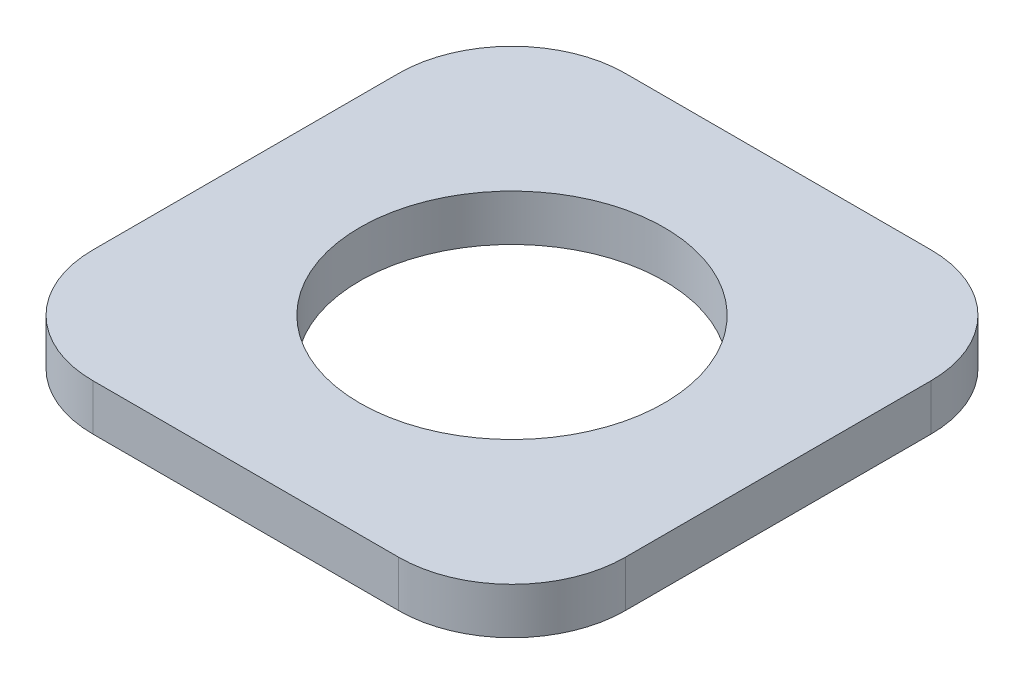
ISO-10303-21;
HEADER;
FILE_DESCRIPTION(('STEP AP214'),'2;1');
FILE_NAME('part.step','',(''),(''),'','','');
FILE_SCHEMA(('AUTOMOTIVE_DESIGN { 1 0 10303 214 1 1 1 1 }'));
ENDSEC;
DATA;
#1=APPLICATION_CONTEXT('core data for automotive mechanical design processes');
#2=APPLICATION_PROTOCOL_DEFINITION('international standard','automotive_design',2000,#1);
#3=PRODUCT_CONTEXT('',#1,'mechanical');
#4=PRODUCT('Part','Part','',(#3));
#5=PRODUCT_RELATED_PRODUCT_CATEGORY('part','',(#4));
#6=PRODUCT_DEFINITION_FORMATION('','',#4);
#7=PRODUCT_DEFINITION_CONTEXT('part definition',#1,'design');
#8=PRODUCT_DEFINITION('design','',#6,#7);
#9=PRODUCT_DEFINITION_SHAPE('','',#8);
#10=(LENGTH_UNIT() NAMED_UNIT(*) SI_UNIT(.MILLI.,.METRE.));
#11=(NAMED_UNIT(*) PLANE_ANGLE_UNIT() SI_UNIT($,.RADIAN.));
#12=(NAMED_UNIT(*) SI_UNIT($,.STERADIAN.) SOLID_ANGLE_UNIT());
#13=UNCERTAINTY_MEASURE_WITH_UNIT(LENGTH_MEASURE(1.E-05),#10,'distance_accuracy_value','');
#14=(GEOMETRIC_REPRESENTATION_CONTEXT(3) GLOBAL_UNCERTAINTY_ASSIGNED_CONTEXT((#13)) GLOBAL_UNIT_ASSIGNED_CONTEXT((#10,
#11,#12)) REPRESENTATION_CONTEXT('',''));
#15=CARTESIAN_POINT('',(0.,0.,0.));
#16=DIRECTION('',(0.,0.,1.));
#17=DIRECTION('',(1.,0.,0.));
#18=AXIS2_PLACEMENT_3D('',#15,#16,#17);
#19=CARTESIAN_POINT('',(46.99,8.1661,-46.99));
#20=DIRECTION('',(-1.,0.,0.));
#21=DIRECTION('',(0.,0.,1.));
#22=AXIS2_PLACEMENT_3D('',#19,#20,#21);
#23=PLANE('',#22);
#24=DIRECTION('',(0.,0.,-1.));
#25=VECTOR('',#24,1.);
#26=CARTESIAN_POINT('',(46.99,8.1661,-46.99));
#27=LINE('',#26,#25);
#28=CARTESIAN_POINT('',(46.99,8.1661,26.99));
#29=VERTEX_POINT('',#28);
#30=CARTESIAN_POINT('',(46.99,8.1661,-26.99));
#31=VERTEX_POINT('',#30);
#32=EDGE_CURVE('E138',#29,#31,#27,.T.);
#33=ORIENTED_EDGE('',*,*,#32,.F.);
#34=DIRECTION('',(0.,-1.,0.));
#35=VECTOR('',#34,1.);
#36=CARTESIAN_POINT('',(46.99,8.1661,26.99));
#37=LINE('',#36,#35);
#38=CARTESIAN_POINT('',(46.99,0.,26.99));
#39=VERTEX_POINT('',#38);
#40=EDGE_CURVE('E177',#29,#39,#37,.T.);
#41=ORIENTED_EDGE('',*,*,#40,.T.);
#42=DIRECTION('',(0.,0.,-1.));
#43=VECTOR('',#42,1.);
#44=CARTESIAN_POINT('',(46.99,0.,-46.99));
#45=LINE('',#44,#43);
#46=CARTESIAN_POINT('',(46.99,0.,-26.99));
#47=VERTEX_POINT('',#46);
#48=EDGE_CURVE('E192',#39,#47,#45,.T.);
#49=ORIENTED_EDGE('',*,*,#48,.T.);
#50=DIRECTION('',(0.,-1.,0.));
#51=VECTOR('',#50,1.);
#52=CARTESIAN_POINT('',(46.99,8.1661,-26.99));
#53=LINE('',#52,#51);
#54=EDGE_CURVE('E174',#47,#31,#53,.F.);
#55=ORIENTED_EDGE('',*,*,#54,.T.);
#56=EDGE_LOOP('',(#33,#41,#49,#55));
#57=FACE_BOUND('',#56,.T.);
#58=ADVANCED_FACE('F42',(#57),#23,.F.);
#59=CARTESIAN_POINT('',(-46.99,8.1661,-46.99));
#60=DIRECTION('',(0.,0.,1.));
#61=DIRECTION('',(1.,0.,0.));
#62=AXIS2_PLACEMENT_3D('',#59,#60,#61);
#63=PLANE('',#62);
#64=DIRECTION('',(-1.,0.,0.));
#65=VECTOR('',#64,1.);
#66=CARTESIAN_POINT('',(-46.99,8.1661,-46.99));
#67=LINE('',#66,#65);
#68=CARTESIAN_POINT('',(26.99,8.1661,-46.99));
#69=VERTEX_POINT('',#68);
#70=CARTESIAN_POINT('',(-26.99,8.1661,-46.99));
#71=VERTEX_POINT('',#70);
#72=EDGE_CURVE('E143',#69,#71,#67,.T.);
#73=ORIENTED_EDGE('',*,*,#72,.F.);
#74=DIRECTION('',(0.,-1.,0.));
#75=VECTOR('',#74,1.);
#76=CARTESIAN_POINT('',(26.99,8.1661,-46.99));
#77=LINE('',#76,#75);
#78=CARTESIAN_POINT('',(26.99,0.,-46.99));
#79=VERTEX_POINT('',#78);
#80=EDGE_CURVE('E11',#69,#79,#77,.T.);
#81=ORIENTED_EDGE('',*,*,#80,.T.);
#82=DIRECTION('',(-1.,0.,0.));
#83=VECTOR('',#82,1.);
#84=CARTESIAN_POINT('',(-46.99,0.,-46.99));
#85=LINE('',#84,#83);
#86=CARTESIAN_POINT('',(-26.99,0.,-46.99));
#87=VERTEX_POINT('',#86);
#88=EDGE_CURVE('E145',#79,#87,#85,.T.);
#89=ORIENTED_EDGE('',*,*,#88,.T.);
#90=DIRECTION('',(0.,-1.,0.));
#91=VECTOR('',#90,1.);
#92=CARTESIAN_POINT('',(-26.99,8.1661,-46.99));
#93=LINE('',#92,#91);
#94=EDGE_CURVE('E51',#87,#71,#93,.F.);
#95=ORIENTED_EDGE('',*,*,#94,.T.);
#96=EDGE_LOOP('',(#73,#81,#89,#95));
#97=FACE_BOUND('',#96,.T.);
#98=ADVANCED_FACE('F198',(#97),#63,.F.);
#99=CARTESIAN_POINT('',(-46.99,8.1661,-46.99));
#100=DIRECTION('',(1.,0.,0.));
#101=DIRECTION('',(0.,0.,-1.));
#102=AXIS2_PLACEMENT_3D('',#99,#100,#101);
#103=PLANE('',#102);
#104=DIRECTION('',(0.,0.,1.));
#105=VECTOR('',#104,1.);
#106=CARTESIAN_POINT('',(-46.99,0.,-46.99));
#107=LINE('',#106,#105);
#108=CARTESIAN_POINT('',(-46.99,0.,-26.99));
#109=VERTEX_POINT('',#108);
#110=CARTESIAN_POINT('',(-46.99,0.,26.99));
#111=VERTEX_POINT('',#110);
#112=EDGE_CURVE('E139',#109,#111,#107,.T.);
#113=ORIENTED_EDGE('',*,*,#112,.T.);
#114=DIRECTION('',(0.,-1.,0.));
#115=VECTOR('',#114,1.);
#116=CARTESIAN_POINT('',(-46.99,8.1661,26.99));
#117=LINE('',#116,#115);
#118=CARTESIAN_POINT('',(-46.99,8.1661,26.99));
#119=VERTEX_POINT('',#118);
#120=EDGE_CURVE('E114',#111,#119,#117,.F.);
#121=ORIENTED_EDGE('',*,*,#120,.T.);
#122=DIRECTION('',(0.,0.,1.));
#123=VECTOR('',#122,1.);
#124=CARTESIAN_POINT('',(-46.99,8.1661,-46.99));
#125=LINE('',#124,#123);
#126=CARTESIAN_POINT('',(-46.99,8.1661,-26.99));
#127=VERTEX_POINT('',#126);
#128=EDGE_CURVE('E183',#127,#119,#125,.T.);
#129=ORIENTED_EDGE('',*,*,#128,.F.);
#130=DIRECTION('',(0.,-1.,0.));
#131=VECTOR('',#130,1.);
#132=CARTESIAN_POINT('',(-46.99,8.1661,-26.99));
#133=LINE('',#132,#131);
#134=EDGE_CURVE('E120',#127,#109,#133,.T.);
#135=ORIENTED_EDGE('',*,*,#134,.T.);
#136=EDGE_LOOP('',(#113,#121,#129,#135));
#137=FACE_BOUND('',#136,.T.);
#138=ADVANCED_FACE('F205',(#137),#103,.F.);
#139=CARTESIAN_POINT('',(-46.99,8.1661,46.99));
#140=DIRECTION('',(0.,0.,-1.));
#141=DIRECTION('',(-1.,0.,0.));
#142=AXIS2_PLACEMENT_3D('',#139,#140,#141);
#143=PLANE('',#142);
#144=DIRECTION('',(1.,0.,0.));
#145=VECTOR('',#144,1.);
#146=CARTESIAN_POINT('',(-46.99,8.1661,46.99));
#147=LINE('',#146,#145);
#148=CARTESIAN_POINT('',(-26.99,8.1661,46.99));
#149=VERTEX_POINT('',#148);
#150=CARTESIAN_POINT('',(26.99,8.1661,46.99));
#151=VERTEX_POINT('',#150);
#152=EDGE_CURVE('E130',#149,#151,#147,.T.);
#153=ORIENTED_EDGE('',*,*,#152,.F.);
#154=DIRECTION('',(0.,-1.,0.));
#155=VECTOR('',#154,1.);
#156=CARTESIAN_POINT('',(-26.99,8.1661,46.99));
#157=LINE('',#156,#155);
#158=CARTESIAN_POINT('',(-26.99,0.,46.99));
#159=VERTEX_POINT('',#158);
#160=EDGE_CURVE('E113',#149,#159,#157,.T.);
#161=ORIENTED_EDGE('',*,*,#160,.T.);
#162=DIRECTION('',(1.,0.,0.));
#163=VECTOR('',#162,1.);
#164=CARTESIAN_POINT('',(-46.99,0.,46.99));
#165=LINE('',#164,#163);
#166=CARTESIAN_POINT('',(26.99,0.,46.99));
#167=VERTEX_POINT('',#166);
#168=EDGE_CURVE('E127',#159,#167,#165,.T.);
#169=ORIENTED_EDGE('',*,*,#168,.T.);
#170=DIRECTION('',(0.,-1.,0.));
#171=VECTOR('',#170,1.);
#172=CARTESIAN_POINT('',(26.99,8.1661,46.99));
#173=LINE('',#172,#171);
#174=EDGE_CURVE('E133',#167,#151,#173,.F.);
#175=ORIENTED_EDGE('',*,*,#174,.T.);
#176=EDGE_LOOP('',(#153,#161,#169,#175));
#177=FACE_BOUND('',#176,.T.);
#178=ADVANCED_FACE('F126',(#177),#143,.F.);
#179=CARTESIAN_POINT('',(0.,8.1661,0.));
#180=DIRECTION('',(0.,1.,0.));
#181=DIRECTION('',(0.,0.,1.));
#182=AXIS2_PLACEMENT_3D('',#179,#180,#181);
#183=PLANE('',#182);
#184=CARTESIAN_POINT('',(0.,8.1661,0.));
#185=DIRECTION('',(0.,1.,0.));
#186=DIRECTION('',(0.,0.,1.));
#187=AXIS2_PLACEMENT_3D('',#184,#185,#186);
#188=CIRCLE('',#187,26.8605);
#189=CARTESIAN_POINT('',(0.,8.1661,26.8605));
#190=VERTEX_POINT('',#189);
#191=EDGE_CURVE('E332',#190,#190,#188,.T.);
#192=ORIENTED_EDGE('',*,*,#191,.F.);
#193=EDGE_LOOP('',(#192));
#194=FACE_BOUND('',#193,.T.);
#195=ORIENTED_EDGE('',*,*,#128,.T.);
#196=CARTESIAN_POINT('',(-26.99,8.1661,26.99));
#197=DIRECTION('',(0.,1.,0.));
#198=DIRECTION('',(0.,0.,1.));
#199=AXIS2_PLACEMENT_3D('',#196,#197,#198);
#200=CIRCLE('',#199,20.);
#201=EDGE_CURVE('E171',#119,#149,#200,.T.);
#202=ORIENTED_EDGE('',*,*,#201,.T.);
#203=ORIENTED_EDGE('',*,*,#152,.T.);
#204=CARTESIAN_POINT('',(26.99,8.1661,26.99));
#205=DIRECTION('',(0.,1.,0.));
#206=DIRECTION('',(0.,0.,1.));
#207=AXIS2_PLACEMENT_3D('',#204,#205,#206);
#208=CIRCLE('',#207,20.);
#209=EDGE_CURVE('E168',#151,#29,#208,.T.);
#210=ORIENTED_EDGE('',*,*,#209,.T.);
#211=ORIENTED_EDGE('',*,*,#32,.T.);
#212=CARTESIAN_POINT('',(26.99,8.1661,-26.99));
#213=DIRECTION('',(0.,1.,0.));
#214=DIRECTION('',(0.,0.,1.));
#215=AXIS2_PLACEMENT_3D('',#212,#213,#214);
#216=CIRCLE('',#215,20.);
#217=EDGE_CURVE('E64',#31,#69,#216,.T.);
#218=ORIENTED_EDGE('',*,*,#217,.T.);
#219=ORIENTED_EDGE('',*,*,#72,.T.);
#220=CARTESIAN_POINT('',(-26.99,8.1661,-26.99));
#221=DIRECTION('',(0.,1.,0.));
#222=DIRECTION('',(0.,0.,1.));
#223=AXIS2_PLACEMENT_3D('',#220,#221,#222);
#224=CIRCLE('',#223,20.);
#225=EDGE_CURVE('E163',#71,#127,#224,.T.);
#226=ORIENTED_EDGE('',*,*,#225,.T.);
#227=EDGE_LOOP('',(#195,#202,#203,#210,#211,#218,#219,#226));
#228=FACE_BOUND('',#227,.T.);
#229=ADVANCED_FACE('F203',(#194,#228),#183,.T.);
#230=CARTESIAN_POINT('',(0.,0.,0.));
#231=DIRECTION('',(0.,1.,0.));
#232=DIRECTION('',(0.,0.,1.));
#233=AXIS2_PLACEMENT_3D('',#230,#231,#232);
#234=PLANE('',#233);
#235=CARTESIAN_POINT('',(0.,0.,0.));
#236=DIRECTION('',(0.,1.,0.));
#237=DIRECTION('',(0.,0.,1.));
#238=AXIS2_PLACEMENT_3D('',#235,#236,#237);
#239=CIRCLE('',#238,26.8605);
#240=CARTESIAN_POINT('',(0.,0.,26.8605));
#241=VERTEX_POINT('',#240);
#242=EDGE_CURVE('E195',#241,#241,#239,.T.);
#243=ORIENTED_EDGE('',*,*,#242,.T.);
#244=EDGE_LOOP('',(#243));
#245=FACE_BOUND('',#244,.T.);
#246=ORIENTED_EDGE('',*,*,#168,.F.);
#247=CARTESIAN_POINT('',(-26.99,0.,26.99));
#248=DIRECTION('',(0.,1.,0.));
#249=DIRECTION('',(0.,0.,1.));
#250=AXIS2_PLACEMENT_3D('',#247,#248,#249);
#251=CIRCLE('',#250,20.);
#252=EDGE_CURVE('E109',#159,#111,#251,.F.);
#253=ORIENTED_EDGE('',*,*,#252,.T.);
#254=ORIENTED_EDGE('',*,*,#112,.F.);
#255=CARTESIAN_POINT('',(-26.99,0.,-26.99));
#256=DIRECTION('',(0.,1.,0.));
#257=DIRECTION('',(0.,0.,1.));
#258=AXIS2_PLACEMENT_3D('',#255,#256,#257);
#259=CIRCLE('',#258,20.);
#260=EDGE_CURVE('E132',#109,#87,#259,.F.);
#261=ORIENTED_EDGE('',*,*,#260,.T.);
#262=ORIENTED_EDGE('',*,*,#88,.F.);
#263=CARTESIAN_POINT('',(26.99,0.,-26.99));
#264=DIRECTION('',(0.,1.,0.));
#265=DIRECTION('',(0.,0.,1.));
#266=AXIS2_PLACEMENT_3D('',#263,#264,#265);
#267=CIRCLE('',#266,20.);
#268=EDGE_CURVE('E153',#79,#47,#267,.F.);
#269=ORIENTED_EDGE('',*,*,#268,.T.);
#270=ORIENTED_EDGE('',*,*,#48,.F.);
#271=CARTESIAN_POINT('',(26.99,0.,26.99));
#272=DIRECTION('',(0.,1.,0.));
#273=DIRECTION('',(0.,0.,1.));
#274=AXIS2_PLACEMENT_3D('',#271,#272,#273);
#275=CIRCLE('',#274,20.);
#276=EDGE_CURVE('E121',#39,#167,#275,.F.);
#277=ORIENTED_EDGE('',*,*,#276,.T.);
#278=EDGE_LOOP('',(#246,#253,#254,#261,#262,#269,#270,#277));
#279=FACE_BOUND('',#278,.T.);
#280=ADVANCED_FACE('F135',(#245,#279),#234,.F.);
#281=CARTESIAN_POINT('',(0.,0.,0.));
#282=DIRECTION('',(0.,1.,0.));
#283=DIRECTION('',(0.,0.,1.));
#284=AXIS2_PLACEMENT_3D('',#281,#282,#283);
#285=CYLINDRICAL_SURFACE('',#284,26.8605);
#286=ORIENTED_EDGE('',*,*,#242,.F.);
#287=EDGE_LOOP('',(#286));
#288=FACE_BOUND('',#287,.T.);
#289=ORIENTED_EDGE('',*,*,#191,.T.);
#290=EDGE_LOOP('',(#289));
#291=FACE_BOUND('',#290,.T.);
#292=ADVANCED_FACE('F225',(#288,#291),#285,.F.);
#293=CARTESIAN_POINT('',(-26.99,8.1661,26.99));
#294=DIRECTION('',(0.,-1.,0.));
#295=DIRECTION('',(0.,0.,-1.));
#296=AXIS2_PLACEMENT_3D('',#293,#294,#295);
#297=CYLINDRICAL_SURFACE('',#296,20.);
#298=ORIENTED_EDGE('',*,*,#201,.F.);
#299=ORIENTED_EDGE('',*,*,#120,.F.);
#300=ORIENTED_EDGE('',*,*,#252,.F.);
#301=ORIENTED_EDGE('',*,*,#160,.F.);
#302=EDGE_LOOP('',(#298,#299,#300,#301));
#303=FACE_BOUND('',#302,.T.);
#304=ADVANCED_FACE('F112',(#303),#297,.T.);
#305=CARTESIAN_POINT('',(26.99,8.1661,26.99));
#306=DIRECTION('',(0.,-1.,0.));
#307=DIRECTION('',(0.,0.,-1.));
#308=AXIS2_PLACEMENT_3D('',#305,#306,#307);
#309=CYLINDRICAL_SURFACE('',#308,20.);
#310=ORIENTED_EDGE('',*,*,#209,.F.);
#311=ORIENTED_EDGE('',*,*,#174,.F.);
#312=ORIENTED_EDGE('',*,*,#276,.F.);
#313=ORIENTED_EDGE('',*,*,#40,.F.);
#314=EDGE_LOOP('',(#310,#311,#312,#313));
#315=FACE_BOUND('',#314,.T.);
#316=ADVANCED_FACE('F224',(#315),#309,.T.);
#317=CARTESIAN_POINT('',(26.99,8.1661,-26.99));
#318=DIRECTION('',(0.,-1.,0.));
#319=DIRECTION('',(0.,0.,-1.));
#320=AXIS2_PLACEMENT_3D('',#317,#318,#319);
#321=CYLINDRICAL_SURFACE('',#320,20.);
#322=ORIENTED_EDGE('',*,*,#217,.F.);
#323=ORIENTED_EDGE('',*,*,#54,.F.);
#324=ORIENTED_EDGE('',*,*,#268,.F.);
#325=ORIENTED_EDGE('',*,*,#80,.F.);
#326=EDGE_LOOP('',(#322,#323,#324,#325));
#327=FACE_BOUND('',#326,.T.);
#328=ADVANCED_FACE('F227',(#327),#321,.T.);
#329=CARTESIAN_POINT('',(-26.99,8.1661,-26.99));
#330=DIRECTION('',(0.,-1.,0.));
#331=DIRECTION('',(0.,0.,-1.));
#332=AXIS2_PLACEMENT_3D('',#329,#330,#331);
#333=CYLINDRICAL_SURFACE('',#332,20.);
#334=ORIENTED_EDGE('',*,*,#225,.F.);
#335=ORIENTED_EDGE('',*,*,#94,.F.);
#336=ORIENTED_EDGE('',*,*,#260,.F.);
#337=ORIENTED_EDGE('',*,*,#134,.F.);
#338=EDGE_LOOP('',(#334,#335,#336,#337));
#339=FACE_BOUND('',#338,.T.);
#340=ADVANCED_FACE('F44',(#339),#333,.T.);
#341=CLOSED_SHELL('',(#58,#98,#138,#178,#229,#280,#292,#304,#316,#328,#340));
#342=MANIFOLD_SOLID_BREP('B2',#341);
#343=ADVANCED_BREP_SHAPE_REPRESENTATION('',(#18,#342),#14);
#344=SHAPE_DEFINITION_REPRESENTATION(#9,#343);
ENDSEC;
END-ISO-10303-21;
